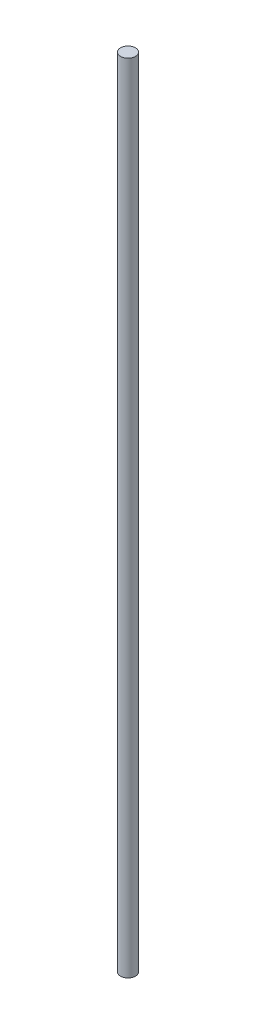
ISO-10303-21;
HEADER;
FILE_DESCRIPTION(('STEP AP214'),'2;1');
FILE_NAME('part.step','',(''),(''),'','','');
FILE_SCHEMA(('AUTOMOTIVE_DESIGN { 1 0 10303 214 1 1 1 1 }'));
ENDSEC;
DATA;
#1=APPLICATION_CONTEXT('core data for automotive mechanical design processes');
#2=APPLICATION_PROTOCOL_DEFINITION('international standard','automotive_design',2000,#1);
#3=PRODUCT_CONTEXT('',#1,'mechanical');
#4=PRODUCT('Part','Part','',(#3));
#5=PRODUCT_RELATED_PRODUCT_CATEGORY('part','',(#4));
#6=PRODUCT_DEFINITION_FORMATION('','',#4);
#7=PRODUCT_DEFINITION_CONTEXT('part definition',#1,'design');
#8=PRODUCT_DEFINITION('design','',#6,#7);
#9=PRODUCT_DEFINITION_SHAPE('','',#8);
#10=(LENGTH_UNIT() NAMED_UNIT(*) SI_UNIT(.MILLI.,.METRE.));
#11=(NAMED_UNIT(*) PLANE_ANGLE_UNIT() SI_UNIT($,.RADIAN.));
#12=(NAMED_UNIT(*) SI_UNIT($,.STERADIAN.) SOLID_ANGLE_UNIT());
#13=UNCERTAINTY_MEASURE_WITH_UNIT(LENGTH_MEASURE(1.E-05),#10,'distance_accuracy_value','');
#14=(GEOMETRIC_REPRESENTATION_CONTEXT(3) GLOBAL_UNCERTAINTY_ASSIGNED_CONTEXT((#13)) GLOBAL_UNIT_ASSIGNED_CONTEXT((#10,
#11,#12)) REPRESENTATION_CONTEXT('',''));
#15=CARTESIAN_POINT('',(0.,0.,0.));
#16=DIRECTION('',(0.,0.,1.));
#17=DIRECTION('',(1.,0.,0.));
#18=AXIS2_PLACEMENT_3D('',#15,#16,#17);
#19=CARTESIAN_POINT('',(0.,254.,0.));
#20=DIRECTION('',(0.,-1.,0.));
#21=DIRECTION('',(0.,0.,-1.));
#22=AXIS2_PLACEMENT_3D('',#19,#20,#21);
#23=CYLINDRICAL_SURFACE('',#22,2.38125);
#24=CARTESIAN_POINT('',(0.,254.,0.));
#25=DIRECTION('',(0.,1.,0.));
#26=DIRECTION('',(0.,0.,1.));
#27=AXIS2_PLACEMENT_3D('',#24,#25,#26);
#28=CIRCLE('',#27,2.38125);
#29=CARTESIAN_POINT('',(0.,254.,2.38125));
#30=VERTEX_POINT('',#29);
#31=EDGE_CURVE('E10',#30,#30,#28,.T.);
#32=ORIENTED_EDGE('',*,*,#31,.F.);
#33=EDGE_LOOP('',(#32));
#34=FACE_BOUND('',#33,.T.);
#35=CARTESIAN_POINT('',(0.,0.,0.));
#36=DIRECTION('',(0.,1.,0.));
#37=DIRECTION('',(0.,0.,1.));
#38=AXIS2_PLACEMENT_3D('',#35,#36,#37);
#39=CIRCLE('',#38,2.38125);
#40=CARTESIAN_POINT('',(0.,0.,2.38125));
#41=VERTEX_POINT('',#40);
#42=EDGE_CURVE('E34',#41,#41,#39,.T.);
#43=ORIENTED_EDGE('',*,*,#42,.T.);
#44=EDGE_LOOP('',(#43));
#45=FACE_BOUND('',#44,.T.);
#46=ADVANCED_FACE('F31',(#34,#45),#23,.T.);
#47=CARTESIAN_POINT('',(0.,254.,0.));
#48=DIRECTION('',(0.,1.,0.));
#49=DIRECTION('',(0.,0.,1.));
#50=AXIS2_PLACEMENT_3D('',#47,#48,#49);
#51=PLANE('',#50);
#52=ORIENTED_EDGE('',*,*,#31,.T.);
#53=EDGE_LOOP('',(#52));
#54=FACE_BOUND('',#53,.T.);
#55=ADVANCED_FACE('F46',(#54),#51,.T.);
#56=CARTESIAN_POINT('',(0.,0.,0.));
#57=DIRECTION('',(0.,1.,0.));
#58=DIRECTION('',(0.,0.,1.));
#59=AXIS2_PLACEMENT_3D('',#56,#57,#58);
#60=PLANE('',#59);
#61=ORIENTED_EDGE('',*,*,#42,.F.);
#62=EDGE_LOOP('',(#61));
#63=FACE_BOUND('',#62,.T.);
#64=ADVANCED_FACE('F44',(#63),#60,.F.);
#65=CLOSED_SHELL('',(#46,#55,#64));
#66=MANIFOLD_SOLID_BREP('B2',#65);
#67=ADVANCED_BREP_SHAPE_REPRESENTATION('',(#18,#66),#14);
#68=SHAPE_DEFINITION_REPRESENTATION(#9,#67);
ENDSEC;
END-ISO-10303-21;
